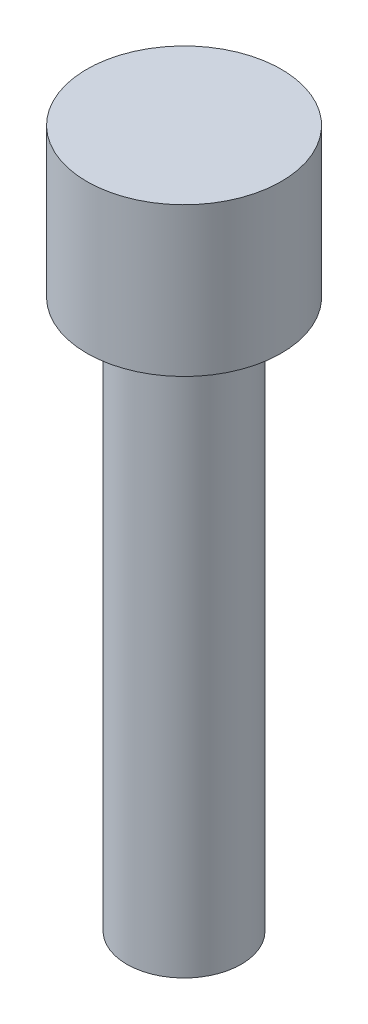
ISO-10303-21;
HEADER;
FILE_DESCRIPTION(('STEP AP214'),'2;1');
FILE_NAME('part.step','',(''),(''),'','','');
FILE_SCHEMA(('AUTOMOTIVE_DESIGN { 1 0 10303 214 1 1 1 1 }'));
ENDSEC;
DATA;
#1=APPLICATION_CONTEXT('core data for automotive mechanical design processes');
#2=APPLICATION_PROTOCOL_DEFINITION('international standard','automotive_design',2000,#1);
#3=PRODUCT_CONTEXT('',#1,'mechanical');
#4=PRODUCT('Part','Part','',(#3));
#5=PRODUCT_RELATED_PRODUCT_CATEGORY('part','',(#4));
#6=PRODUCT_DEFINITION_FORMATION('','',#4);
#7=PRODUCT_DEFINITION_CONTEXT('part definition',#1,'design');
#8=PRODUCT_DEFINITION('design','',#6,#7);
#9=PRODUCT_DEFINITION_SHAPE('','',#8);
#10=(LENGTH_UNIT() NAMED_UNIT(*) SI_UNIT(.MILLI.,.METRE.));
#11=(NAMED_UNIT(*) PLANE_ANGLE_UNIT() SI_UNIT($,.RADIAN.));
#12=(NAMED_UNIT(*) SI_UNIT($,.STERADIAN.) SOLID_ANGLE_UNIT());
#13=UNCERTAINTY_MEASURE_WITH_UNIT(LENGTH_MEASURE(1.E-05),#10,'distance_accuracy_value','');
#14=(GEOMETRIC_REPRESENTATION_CONTEXT(3) GLOBAL_UNCERTAINTY_ASSIGNED_CONTEXT((#13)) GLOBAL_UNIT_ASSIGNED_CONTEXT((#10,
#11,#12)) REPRESENTATION_CONTEXT('',''));
#15=CARTESIAN_POINT('',(0.,0.,0.));
#16=DIRECTION('',(0.,0.,1.));
#17=DIRECTION('',(1.,0.,0.));
#18=AXIS2_PLACEMENT_3D('',#15,#16,#17);
#19=CARTESIAN_POINT('',(0.,24.,0.));
#20=DIRECTION('',(0.,-1.,0.));
#21=DIRECTION('',(0.,0.,-1.));
#22=AXIS2_PLACEMENT_3D('',#19,#20,#21);
#23=CYLINDRICAL_SURFACE('',#22,2.5);
#24=CARTESIAN_POINT('',(0.,24.,0.));
#25=DIRECTION('',(0.,1.,0.));
#26=DIRECTION('',(0.,0.,1.));
#27=AXIS2_PLACEMENT_3D('',#24,#25,#26);
#28=CIRCLE('',#27,2.5);
#29=CARTESIAN_POINT('',(0.,24.,2.5));
#30=VERTEX_POINT('',#29);
#31=EDGE_CURVE('E10',#30,#30,#28,.T.);
#32=ORIENTED_EDGE('',*,*,#31,.F.);
#33=EDGE_LOOP('',(#32));
#34=FACE_BOUND('',#33,.T.);
#35=CARTESIAN_POINT('',(0.,0.,0.));
#36=DIRECTION('',(0.,1.,0.));
#37=DIRECTION('',(0.,0.,1.));
#38=AXIS2_PLACEMENT_3D('',#35,#36,#37);
#39=CIRCLE('',#38,2.5);
#40=CARTESIAN_POINT('',(0.,0.,2.5));
#41=VERTEX_POINT('',#40);
#42=EDGE_CURVE('E44',#41,#41,#39,.T.);
#43=ORIENTED_EDGE('',*,*,#42,.T.);
#44=EDGE_LOOP('',(#43));
#45=FACE_BOUND('',#44,.T.);
#46=ADVANCED_FACE('F41',(#34,#45),#23,.T.);
#47=CARTESIAN_POINT('',(0.,0.,0.));
#48=DIRECTION('',(0.,1.,0.));
#49=DIRECTION('',(0.,0.,1.));
#50=AXIS2_PLACEMENT_3D('',#47,#48,#49);
#51=PLANE('',#50);
#52=ORIENTED_EDGE('',*,*,#42,.F.);
#53=EDGE_LOOP('',(#52));
#54=FACE_BOUND('',#53,.T.);
#55=ADVANCED_FACE('F68',(#54),#51,.F.);
#56=CARTESIAN_POINT('',(0.,30.5,0.));
#57=DIRECTION('',(0.,-1.,0.));
#58=DIRECTION('',(0.,0.,-1.));
#59=AXIS2_PLACEMENT_3D('',#56,#57,#58);
#60=CYLINDRICAL_SURFACE('',#59,4.25);
#61=CARTESIAN_POINT('',(0.,30.5,0.));
#62=DIRECTION('',(0.,1.,0.));
#63=DIRECTION('',(0.,0.,1.));
#64=AXIS2_PLACEMENT_3D('',#61,#62,#63);
#65=CIRCLE('',#64,4.25);
#66=CARTESIAN_POINT('',(0.,30.5,4.25));
#67=VERTEX_POINT('',#66);
#68=EDGE_CURVE('E53',#67,#67,#65,.T.);
#69=ORIENTED_EDGE('',*,*,#68,.F.);
#70=EDGE_LOOP('',(#69));
#71=FACE_BOUND('',#70,.T.);
#72=CARTESIAN_POINT('',(0.,24.,0.));
#73=DIRECTION('',(0.,1.,0.));
#74=DIRECTION('',(0.,0.,1.));
#75=AXIS2_PLACEMENT_3D('',#72,#73,#74);
#76=CIRCLE('',#75,4.25);
#77=CARTESIAN_POINT('',(0.,24.,4.25));
#78=VERTEX_POINT('',#77);
#79=EDGE_CURVE('E55',#78,#78,#76,.T.);
#80=ORIENTED_EDGE('',*,*,#79,.T.);
#81=EDGE_LOOP('',(#80));
#82=FACE_BOUND('',#81,.T.);
#83=ADVANCED_FACE('F65',(#71,#82),#60,.T.);
#84=CARTESIAN_POINT('',(0.,30.5,0.));
#85=DIRECTION('',(0.,1.,0.));
#86=DIRECTION('',(0.,0.,1.));
#87=AXIS2_PLACEMENT_3D('',#84,#85,#86);
#88=PLANE('',#87);
#89=ORIENTED_EDGE('',*,*,#68,.T.);
#90=EDGE_LOOP('',(#89));
#91=FACE_BOUND('',#90,.T.);
#92=ADVANCED_FACE('F63',(#91),#88,.T.);
#93=CARTESIAN_POINT('',(0.,24.,0.));
#94=DIRECTION('',(0.,1.,0.));
#95=DIRECTION('',(0.,0.,1.));
#96=AXIS2_PLACEMENT_3D('',#93,#94,#95);
#97=PLANE('',#96);
#98=ORIENTED_EDGE('',*,*,#31,.T.);
#99=EDGE_LOOP('',(#98));
#100=FACE_BOUND('',#99,.T.);
#101=ORIENTED_EDGE('',*,*,#79,.F.);
#102=EDGE_LOOP('',(#101));
#103=FACE_BOUND('',#102,.T.);
#104=ADVANCED_FACE('F72',(#100,#103),#97,.F.);
#105=CLOSED_SHELL('',(#46,#55,#83,#92,#104));
#106=MANIFOLD_SOLID_BREP('B2',#105);
#107=ADVANCED_BREP_SHAPE_REPRESENTATION('',(#18,#106),#14);
#108=SHAPE_DEFINITION_REPRESENTATION(#9,#107);
ENDSEC;
END-ISO-10303-21;
